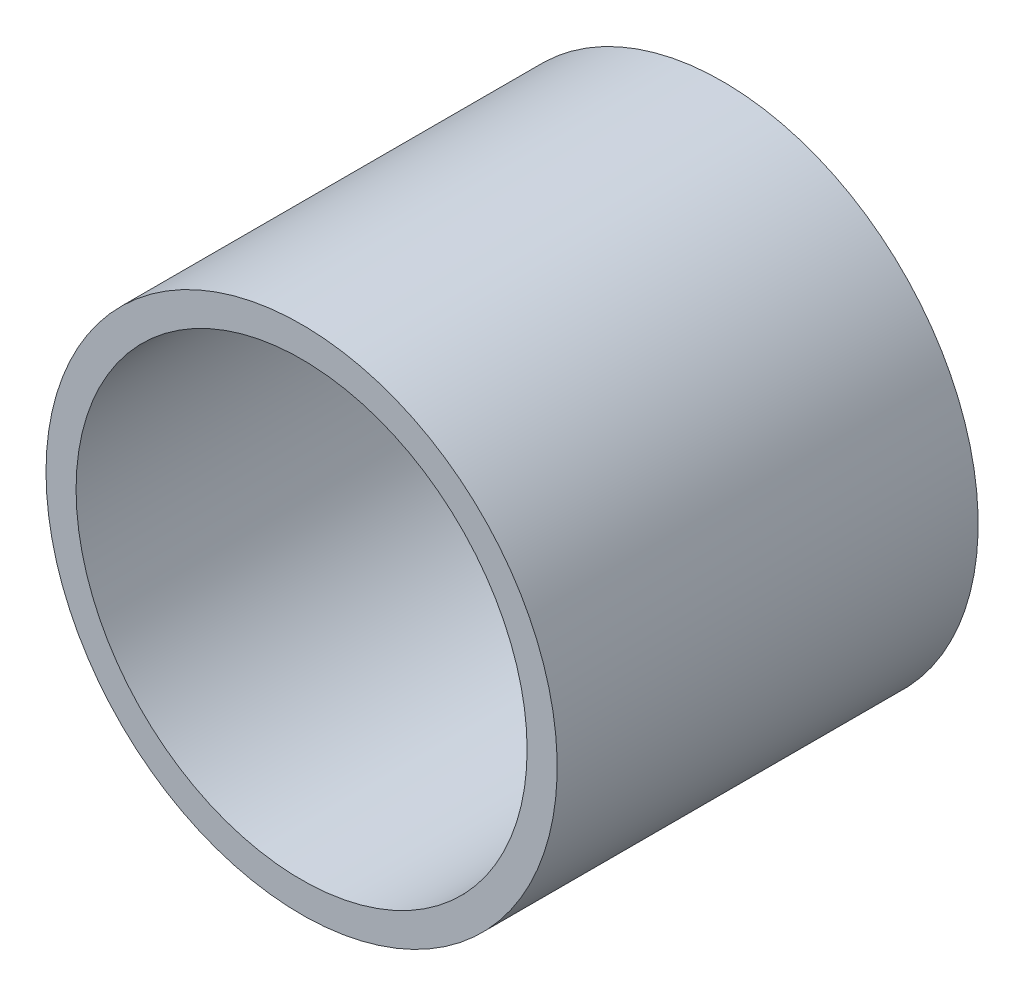
ISO-10303-21;
HEADER;
FILE_DESCRIPTION(('STEP AP214'),'2;1');
FILE_NAME('part.step','',(''),(''),'','','');
FILE_SCHEMA(('AUTOMOTIVE_DESIGN { 1 0 10303 214 1 1 1 1 }'));
ENDSEC;
DATA;
#1=APPLICATION_CONTEXT('core data for automotive mechanical design processes');
#2=APPLICATION_PROTOCOL_DEFINITION('international standard','automotive_design',2000,#1);
#3=PRODUCT_CONTEXT('',#1,'mechanical');
#4=PRODUCT('Part','Part','',(#3));
#5=PRODUCT_RELATED_PRODUCT_CATEGORY('part','',(#4));
#6=PRODUCT_DEFINITION_FORMATION('','',#4);
#7=PRODUCT_DEFINITION_CONTEXT('part definition',#1,'design');
#8=PRODUCT_DEFINITION('design','',#6,#7);
#9=PRODUCT_DEFINITION_SHAPE('','',#8);
#10=(LENGTH_UNIT() NAMED_UNIT(*) SI_UNIT(.MILLI.,.METRE.));
#11=(NAMED_UNIT(*) PLANE_ANGLE_UNIT() SI_UNIT($,.RADIAN.));
#12=(NAMED_UNIT(*) SI_UNIT($,.STERADIAN.) SOLID_ANGLE_UNIT());
#13=UNCERTAINTY_MEASURE_WITH_UNIT(LENGTH_MEASURE(1.E-05),#10,'distance_accuracy_value','');
#14=(GEOMETRIC_REPRESENTATION_CONTEXT(3) GLOBAL_UNCERTAINTY_ASSIGNED_CONTEXT((#13)) GLOBAL_UNIT_ASSIGNED_CONTEXT((#10,
#11,#12)) REPRESENTATION_CONTEXT('',''));
#15=CARTESIAN_POINT('',(0.,0.,0.));
#16=DIRECTION('',(0.,0.,1.));
#17=DIRECTION('',(1.,0.,0.));
#18=AXIS2_PLACEMENT_3D('',#15,#16,#17);
#19=CARTESIAN_POINT('',(0.,0.,14.224));
#20=DIRECTION('',(0.,0.,-1.));
#21=DIRECTION('',(-1.,0.,0.));
#22=AXIS2_PLACEMENT_3D('',#19,#20,#21);
#23=CYLINDRICAL_SURFACE('',#22,7.62);
#24=CARTESIAN_POINT('',(0.,0.,0.));
#25=DIRECTION('',(0.,0.,-1.));
#26=DIRECTION('',(-1.,0.,0.));
#27=AXIS2_PLACEMENT_3D('',#24,#25,#26);
#28=CIRCLE('',#27,7.62);
#29=CARTESIAN_POINT('',(-7.62,0.,0.));
#30=VERTEX_POINT('',#29);
#31=EDGE_CURVE('E27',#30,#30,#28,.T.);
#32=ORIENTED_EDGE('',*,*,#31,.T.);
#33=EDGE_LOOP('',(#32));
#34=FACE_BOUND('',#33,.T.);
#35=CARTESIAN_POINT('',(0.,0.,14.224));
#36=DIRECTION('',(0.,0.,-1.));
#37=DIRECTION('',(-1.,0.,0.));
#38=AXIS2_PLACEMENT_3D('',#35,#36,#37);
#39=CIRCLE('',#38,7.62);
#40=CARTESIAN_POINT('',(-7.62,0.,14.224));
#41=VERTEX_POINT('',#40);
#42=EDGE_CURVE('E18',#41,#41,#39,.T.);
#43=ORIENTED_EDGE('',*,*,#42,.F.);
#44=EDGE_LOOP('',(#43));
#45=FACE_BOUND('',#44,.T.);
#46=ADVANCED_FACE('F15',(#34,#45),#23,.F.);
#47=CARTESIAN_POINT('',(0.,0.,14.224));
#48=DIRECTION('',(0.,0.,1.));
#49=DIRECTION('',(1.,0.,0.));
#50=AXIS2_PLACEMENT_3D('',#47,#48,#49);
#51=PLANE('',#50);
#52=ORIENTED_EDGE('',*,*,#42,.T.);
#53=EDGE_LOOP('',(#52));
#54=FACE_BOUND('',#53,.T.);
#55=CARTESIAN_POINT('',(0.,0.,14.224));
#56=DIRECTION('',(0.,0.,-1.));
#57=DIRECTION('',(-1.,0.,0.));
#58=AXIS2_PLACEMENT_3D('',#55,#56,#57);
#59=CIRCLE('',#58,8.636);
#60=CARTESIAN_POINT('',(-8.636,0.,14.224));
#61=VERTEX_POINT('',#60);
#62=EDGE_CURVE('E22',#61,#61,#59,.T.);
#63=ORIENTED_EDGE('',*,*,#62,.F.);
#64=EDGE_LOOP('',(#63));
#65=FACE_BOUND('',#64,.T.);
#66=ADVANCED_FACE('F35',(#54,#65),#51,.T.);
#67=CARTESIAN_POINT('',(0.,0.,0.));
#68=DIRECTION('',(0.,0.,1.));
#69=DIRECTION('',(1.,0.,0.));
#70=AXIS2_PLACEMENT_3D('',#67,#68,#69);
#71=PLANE('',#70);
#72=ORIENTED_EDGE('',*,*,#31,.F.);
#73=EDGE_LOOP('',(#72));
#74=FACE_BOUND('',#73,.T.);
#75=CARTESIAN_POINT('',(0.,0.,0.));
#76=DIRECTION('',(0.,0.,-1.));
#77=DIRECTION('',(-1.,0.,0.));
#78=AXIS2_PLACEMENT_3D('',#75,#76,#77);
#79=CIRCLE('',#78,8.636);
#80=CARTESIAN_POINT('',(-8.636,0.,0.));
#81=VERTEX_POINT('',#80);
#82=EDGE_CURVE('E10',#81,#81,#79,.F.);
#83=ORIENTED_EDGE('',*,*,#82,.F.);
#84=EDGE_LOOP('',(#83));
#85=FACE_BOUND('',#84,.T.);
#86=ADVANCED_FACE('F43',(#74,#85),#71,.F.);
#87=CARTESIAN_POINT('',(0.,0.,14.224));
#88=DIRECTION('',(0.,0.,-1.));
#89=DIRECTION('',(-1.,0.,0.));
#90=AXIS2_PLACEMENT_3D('',#87,#88,#89);
#91=CYLINDRICAL_SURFACE('',#90,8.636);
#92=ORIENTED_EDGE('',*,*,#82,.T.);
#93=EDGE_LOOP('',(#92));
#94=FACE_BOUND('',#93,.T.);
#95=ORIENTED_EDGE('',*,*,#62,.T.);
#96=EDGE_LOOP('',(#95));
#97=FACE_BOUND('',#96,.T.);
#98=ADVANCED_FACE('F44',(#94,#97),#91,.T.);
#99=CLOSED_SHELL('',(#46,#66,#86,#98));
#100=MANIFOLD_SOLID_BREP('B1',#99);
#101=ADVANCED_BREP_SHAPE_REPRESENTATION('',(#18,#100),#14);
#102=SHAPE_DEFINITION_REPRESENTATION(#9,#101);
ENDSEC;
END-ISO-10303-21;
